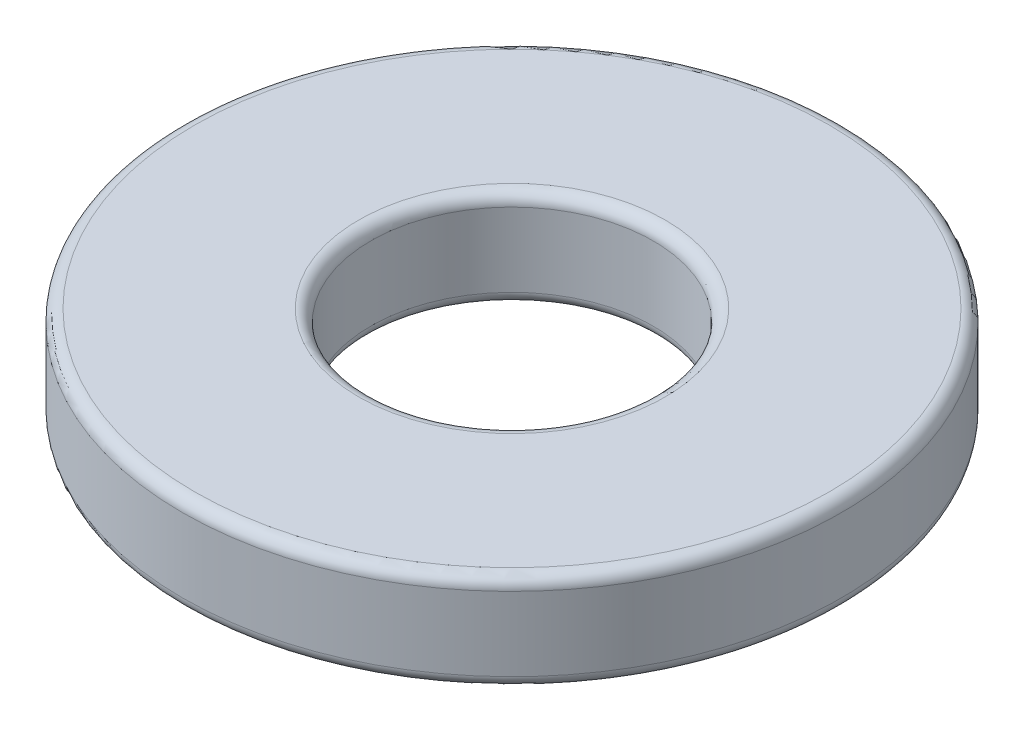
ISO-10303-21;
HEADER;
FILE_DESCRIPTION(('STEP AP214'),'2;1');
FILE_NAME('part.step','',(''),(''),'','','');
FILE_SCHEMA(('AUTOMOTIVE_DESIGN { 1 0 10303 214 1 1 1 1 }'));
ENDSEC;
DATA;
#1=APPLICATION_CONTEXT('core data for automotive mechanical design processes');
#2=APPLICATION_PROTOCOL_DEFINITION('international standard','automotive_design',2000,#1);
#3=PRODUCT_CONTEXT('',#1,'mechanical');
#4=PRODUCT('Part','Part','',(#3));
#5=PRODUCT_RELATED_PRODUCT_CATEGORY('part','',(#4));
#6=PRODUCT_DEFINITION_FORMATION('','',#4);
#7=PRODUCT_DEFINITION_CONTEXT('part definition',#1,'design');
#8=PRODUCT_DEFINITION('design','',#6,#7);
#9=PRODUCT_DEFINITION_SHAPE('','',#8);
#10=(LENGTH_UNIT() NAMED_UNIT(*) SI_UNIT(.MILLI.,.METRE.));
#11=(NAMED_UNIT(*) PLANE_ANGLE_UNIT() SI_UNIT($,.RADIAN.));
#12=(NAMED_UNIT(*) SI_UNIT($,.STERADIAN.) SOLID_ANGLE_UNIT());
#13=UNCERTAINTY_MEASURE_WITH_UNIT(LENGTH_MEASURE(1.E-05),#10,'distance_accuracy_value','');
#14=(GEOMETRIC_REPRESENTATION_CONTEXT(3) GLOBAL_UNCERTAINTY_ASSIGNED_CONTEXT((#13)) GLOBAL_UNIT_ASSIGNED_CONTEXT((#10,
#11,#12)) REPRESENTATION_CONTEXT('',''));
#15=CARTESIAN_POINT('',(0.,0.,0.));
#16=DIRECTION('',(0.,0.,1.));
#17=DIRECTION('',(1.,0.,0.));
#18=AXIS2_PLACEMENT_3D('',#15,#16,#17);
#19=CARTESIAN_POINT('',(0.,1.651,0.));
#20=DIRECTION('',(0.,-1.,0.));
#21=DIRECTION('',(0.,0.,-1.));
#22=AXIS2_PLACEMENT_3D('',#19,#20,#21);
#23=CYLINDRICAL_SURFACE('',#22,5.55625);
#24=CARTESIAN_POINT('',(0.,0.2032,0.));
#25=DIRECTION('',(0.,1.,0.));
#26=DIRECTION('',(0.,0.,1.));
#27=AXIS2_PLACEMENT_3D('',#24,#25,#26);
#28=CIRCLE('',#27,5.55625);
#29=CARTESIAN_POINT('',(0.,0.2032,5.55625));
#30=VERTEX_POINT('',#29);
#31=EDGE_CURVE('E57',#30,#30,#28,.T.);
#32=ORIENTED_EDGE('',*,*,#31,.T.);
#33=EDGE_LOOP('',(#32));
#34=FACE_BOUND('',#33,.T.);
#35=CARTESIAN_POINT('',(0.,1.4478,0.));
#36=DIRECTION('',(0.,1.,0.));
#37=DIRECTION('',(0.,0.,1.));
#38=AXIS2_PLACEMENT_3D('',#35,#36,#37);
#39=CIRCLE('',#38,5.55625);
#40=CARTESIAN_POINT('',(0.,1.4478,5.55625));
#41=VERTEX_POINT('',#40);
#42=EDGE_CURVE('E60',#41,#41,#39,.F.);
#43=ORIENTED_EDGE('',*,*,#42,.T.);
#44=EDGE_LOOP('',(#43));
#45=FACE_BOUND('',#44,.T.);
#46=ADVANCED_FACE('F31',(#34,#45),#23,.T.);
#47=CARTESIAN_POINT('',(0.,1.651,0.));
#48=DIRECTION('',(0.,1.,0.));
#49=DIRECTION('',(0.,0.,1.));
#50=AXIS2_PLACEMENT_3D('',#47,#48,#49);
#51=PLANE('',#50);
#52=CARTESIAN_POINT('',(0.,1.651,0.));
#53=DIRECTION('',(0.,1.,0.));
#54=DIRECTION('',(0.,0.,1.));
#55=AXIS2_PLACEMENT_3D('',#52,#53,#54);
#56=CIRCLE('',#55,5.35305);
#57=CARTESIAN_POINT('',(0.,1.651,5.35305));
#58=VERTEX_POINT('',#57);
#59=EDGE_CURVE('E42',#58,#58,#56,.T.);
#60=ORIENTED_EDGE('',*,*,#59,.T.);
#61=EDGE_LOOP('',(#60));
#62=FACE_BOUND('',#61,.T.);
#63=CARTESIAN_POINT('',(0.,1.651,0.));
#64=DIRECTION('',(0.,1.,0.));
#65=DIRECTION('',(0.,0.,1.));
#66=AXIS2_PLACEMENT_3D('',#63,#64,#65);
#67=CIRCLE('',#66,2.58445);
#68=CARTESIAN_POINT('',(0.,1.651,2.58445));
#69=VERTEX_POINT('',#68);
#70=EDGE_CURVE('E46',#69,#69,#67,.F.);
#71=ORIENTED_EDGE('',*,*,#70,.T.);
#72=EDGE_LOOP('',(#71));
#73=FACE_BOUND('',#72,.T.);
#74=ADVANCED_FACE('F73',(#62,#73),#51,.T.);
#75=CARTESIAN_POINT('',(0.,0.,0.));
#76=DIRECTION('',(0.,1.,0.));
#77=DIRECTION('',(0.,0.,1.));
#78=AXIS2_PLACEMENT_3D('',#75,#76,#77);
#79=PLANE('',#78);
#80=CARTESIAN_POINT('',(0.,0.,0.));
#81=DIRECTION('',(0.,1.,0.));
#82=DIRECTION('',(0.,0.,1.));
#83=AXIS2_PLACEMENT_3D('',#80,#81,#82);
#84=CIRCLE('',#83,5.35305);
#85=CARTESIAN_POINT('',(0.,0.,5.35305));
#86=VERTEX_POINT('',#85);
#87=EDGE_CURVE('E51',#86,#86,#84,.F.);
#88=ORIENTED_EDGE('',*,*,#87,.T.);
#89=EDGE_LOOP('',(#88));
#90=FACE_BOUND('',#89,.T.);
#91=CARTESIAN_POINT('',(0.,0.,0.));
#92=DIRECTION('',(0.,1.,0.));
#93=DIRECTION('',(0.,0.,1.));
#94=AXIS2_PLACEMENT_3D('',#91,#92,#93);
#95=CIRCLE('',#94,2.58445);
#96=CARTESIAN_POINT('',(0.,0.,2.58445));
#97=VERTEX_POINT('',#96);
#98=EDGE_CURVE('E54',#97,#97,#95,.T.);
#99=ORIENTED_EDGE('',*,*,#98,.T.);
#100=EDGE_LOOP('',(#99));
#101=FACE_BOUND('',#100,.T.);
#102=ADVANCED_FACE('F76',(#90,#101),#79,.F.);
#103=CARTESIAN_POINT('',(0.,0.,0.));
#104=DIRECTION('',(0.,1.,0.));
#105=DIRECTION('',(0.,0.,1.));
#106=AXIS2_PLACEMENT_3D('',#103,#104,#105);
#107=CYLINDRICAL_SURFACE('',#106,2.38125);
#108=CARTESIAN_POINT('',(0.,1.4478,0.));
#109=DIRECTION('',(0.,1.,0.));
#110=DIRECTION('',(0.,0.,1.));
#111=AXIS2_PLACEMENT_3D('',#108,#109,#110);
#112=CIRCLE('',#111,2.38125);
#113=CARTESIAN_POINT('',(0.,1.4478,2.38125));
#114=VERTEX_POINT('',#113);
#115=EDGE_CURVE('E10',#114,#114,#112,.T.);
#116=ORIENTED_EDGE('',*,*,#115,.T.);
#117=EDGE_LOOP('',(#116));
#118=FACE_BOUND('',#117,.T.);
#119=CARTESIAN_POINT('',(0.,0.2032,0.));
#120=DIRECTION('',(0.,1.,0.));
#121=DIRECTION('',(0.,0.,1.));
#122=AXIS2_PLACEMENT_3D('',#119,#120,#121);
#123=CIRCLE('',#122,2.38125);
#124=CARTESIAN_POINT('',(0.,0.2032,2.38125));
#125=VERTEX_POINT('',#124);
#126=EDGE_CURVE('E38',#125,#125,#123,.F.);
#127=ORIENTED_EDGE('',*,*,#126,.T.);
#128=EDGE_LOOP('',(#127));
#129=FACE_BOUND('',#128,.T.);
#130=ADVANCED_FACE('F94',(#118,#129),#107,.F.);
#131=CARTESIAN_POINT('',(0.,0.2032,0.));
#132=DIRECTION('',(0.,1.,0.));
#133=DIRECTION('',(0.,0.,1.));
#134=AXIS2_PLACEMENT_3D('',#131,#132,#133);
#135=TOROIDAL_SURFACE('',#134,5.35305,0.2032);
#136=ORIENTED_EDGE('',*,*,#87,.F.);
#137=EDGE_LOOP('',(#136));
#138=FACE_BOUND('',#137,.T.);
#139=ORIENTED_EDGE('',*,*,#31,.F.);
#140=EDGE_LOOP('',(#139));
#141=FACE_BOUND('',#140,.T.);
#142=ADVANCED_FACE('F69',(#138,#141),#135,.T.);
#143=CARTESIAN_POINT('',(0.,1.4478,0.));
#144=DIRECTION('',(0.,1.,0.));
#145=DIRECTION('',(0.,0.,1.));
#146=AXIS2_PLACEMENT_3D('',#143,#144,#145);
#147=TOROIDAL_SURFACE('',#146,5.35305,0.2032);
#148=ORIENTED_EDGE('',*,*,#42,.F.);
#149=EDGE_LOOP('',(#148));
#150=FACE_BOUND('',#149,.T.);
#151=ORIENTED_EDGE('',*,*,#59,.F.);
#152=EDGE_LOOP('',(#151));
#153=FACE_BOUND('',#152,.T.);
#154=ADVANCED_FACE('F65',(#150,#153),#147,.T.);
#155=CARTESIAN_POINT('',(0.,1.4478,0.));
#156=DIRECTION('',(0.,1.,0.));
#157=DIRECTION('',(0.,0.,1.));
#158=AXIS2_PLACEMENT_3D('',#155,#156,#157);
#159=TOROIDAL_SURFACE('',#158,2.58445,0.2032);
#160=ORIENTED_EDGE('',*,*,#70,.F.);
#161=EDGE_LOOP('',(#160));
#162=FACE_BOUND('',#161,.T.);
#163=ORIENTED_EDGE('',*,*,#115,.F.);
#164=EDGE_LOOP('',(#163));
#165=FACE_BOUND('',#164,.T.);
#166=ADVANCED_FACE('F68',(#162,#165),#159,.T.);
#167=CARTESIAN_POINT('',(0.,0.2032,0.));
#168=DIRECTION('',(0.,1.,0.));
#169=DIRECTION('',(0.,0.,1.));
#170=AXIS2_PLACEMENT_3D('',#167,#168,#169);
#171=TOROIDAL_SURFACE('',#170,2.58445,0.2032);
#172=ORIENTED_EDGE('',*,*,#126,.F.);
#173=EDGE_LOOP('',(#172));
#174=FACE_BOUND('',#173,.T.);
#175=ORIENTED_EDGE('',*,*,#98,.F.);
#176=EDGE_LOOP('',(#175));
#177=FACE_BOUND('',#176,.T.);
#178=ADVANCED_FACE('F33',(#174,#177),#171,.T.);
#179=CLOSED_SHELL('',(#46,#74,#102,#130,#142,#154,#166,#178));
#180=MANIFOLD_SOLID_BREP('B2',#179);
#181=ADVANCED_BREP_SHAPE_REPRESENTATION('',(#18,#180),#14);
#182=SHAPE_DEFINITION_REPRESENTATION(#9,#181);
ENDSEC;
END-ISO-10303-21;
